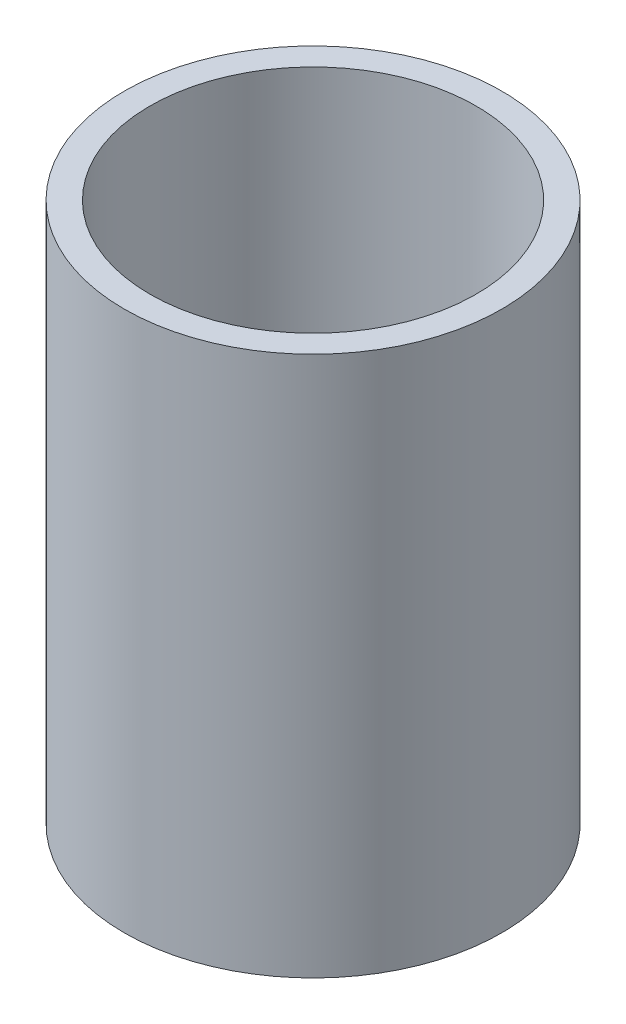
ISO-10303-21;
HEADER;
FILE_DESCRIPTION(('STEP AP214'),'2;1');
FILE_NAME('part.step','',(''),(''),'','','');
FILE_SCHEMA(('AUTOMOTIVE_DESIGN { 1 0 10303 214 1 1 1 1 }'));
ENDSEC;
DATA;
#1=APPLICATION_CONTEXT('core data for automotive mechanical design processes');
#2=APPLICATION_PROTOCOL_DEFINITION('international standard','automotive_design',2000,#1);
#3=PRODUCT_CONTEXT('',#1,'mechanical');
#4=PRODUCT('Part','Part','',(#3));
#5=PRODUCT_RELATED_PRODUCT_CATEGORY('part','',(#4));
#6=PRODUCT_DEFINITION_FORMATION('','',#4);
#7=PRODUCT_DEFINITION_CONTEXT('part definition',#1,'design');
#8=PRODUCT_DEFINITION('design','',#6,#7);
#9=PRODUCT_DEFINITION_SHAPE('','',#8);
#10=(LENGTH_UNIT() NAMED_UNIT(*) SI_UNIT(.MILLI.,.METRE.));
#11=(NAMED_UNIT(*) PLANE_ANGLE_UNIT() SI_UNIT($,.RADIAN.));
#12=(NAMED_UNIT(*) SI_UNIT($,.STERADIAN.) SOLID_ANGLE_UNIT());
#13=UNCERTAINTY_MEASURE_WITH_UNIT(LENGTH_MEASURE(1.E-05),#10,'distance_accuracy_value','');
#14=(GEOMETRIC_REPRESENTATION_CONTEXT(3) GLOBAL_UNCERTAINTY_ASSIGNED_CONTEXT((#13)) GLOBAL_UNIT_ASSIGNED_CONTEXT((#10,
#11,#12)) REPRESENTATION_CONTEXT('',''));
#15=CARTESIAN_POINT('',(0.,0.,0.));
#16=DIRECTION('',(0.,0.,1.));
#17=DIRECTION('',(1.,0.,0.));
#18=AXIS2_PLACEMENT_3D('',#15,#16,#17);
#19=CARTESIAN_POINT('',(0.,55.,0.));
#20=DIRECTION('',(0.,1.,0.));
#21=DIRECTION('',(0.,0.,1.));
#22=AXIS2_PLACEMENT_3D('',#19,#20,#21);
#23=CYLINDRICAL_SURFACE('',#22,46.609);
#24=CARTESIAN_POINT('',(0.,-87.732365567385,0.));
#25=DIRECTION('',(0.,1.,0.));
#26=DIRECTION('',(0.,0.,1.));
#27=AXIS2_PLACEMENT_3D('',#24,#25,#26);
#28=CIRCLE('',#27,46.609);
#29=CARTESIAN_POINT('',(0.,-87.732365567385,46.609));
#30=VERTEX_POINT('',#29);
#31=EDGE_CURVE('E12',#30,#30,#28,.T.);
#32=ORIENTED_EDGE('',*,*,#31,.T.);
#33=EDGE_LOOP('',(#32));
#34=FACE_BOUND('',#33,.T.);
#35=CARTESIAN_POINT('',(0.,45.6176344326149,0.));
#36=DIRECTION('',(0.,1.,0.));
#37=DIRECTION('',(0.,0.,1.));
#38=AXIS2_PLACEMENT_3D('',#35,#36,#37);
#39=CIRCLE('',#38,46.609);
#40=CARTESIAN_POINT('',(0.,45.6176344326149,46.609));
#41=VERTEX_POINT('',#40);
#42=EDGE_CURVE('E55',#41,#41,#39,.T.);
#43=ORIENTED_EDGE('',*,*,#42,.F.);
#44=EDGE_LOOP('',(#43));
#45=FACE_BOUND('',#44,.T.);
#46=ADVANCED_FACE('F41',(#34,#45),#23,.T.);
#47=CARTESIAN_POINT('',(-46.609,-87.7323655673851,0.));
#48=DIRECTION('',(0.,-1.,0.));
#49=DIRECTION('',(0.,0.,-1.));
#50=AXIS2_PLACEMENT_3D('',#47,#48,#49);
#51=PLANE('',#50);
#52=CARTESIAN_POINT('',(0.,-87.732365567385,0.));
#53=DIRECTION('',(0.,1.,0.));
#54=DIRECTION('',(0.,0.,1.));
#55=AXIS2_PLACEMENT_3D('',#52,#53,#54);
#56=CIRCLE('',#55,40.259);
#57=CARTESIAN_POINT('',(0.,-87.732365567385,40.259));
#58=VERTEX_POINT('',#57);
#59=EDGE_CURVE('E47',#58,#58,#56,.T.);
#60=ORIENTED_EDGE('',*,*,#59,.T.);
#61=EDGE_LOOP('',(#60));
#62=FACE_BOUND('',#61,.T.);
#63=ORIENTED_EDGE('',*,*,#31,.F.);
#64=EDGE_LOOP('',(#63));
#65=FACE_BOUND('',#64,.T.);
#66=ADVANCED_FACE('F65',(#62,#65),#51,.T.);
#67=CARTESIAN_POINT('',(0.,55.,0.));
#68=DIRECTION('',(0.,1.,0.));
#69=DIRECTION('',(0.,0.,1.));
#70=AXIS2_PLACEMENT_3D('',#67,#68,#69);
#71=CYLINDRICAL_SURFACE('',#70,40.259);
#72=CARTESIAN_POINT('',(0.,45.6176344326149,0.));
#73=DIRECTION('',(0.,1.,0.));
#74=DIRECTION('',(0.,0.,1.));
#75=AXIS2_PLACEMENT_3D('',#72,#73,#74);
#76=CIRCLE('',#75,40.259);
#77=CARTESIAN_POINT('',(0.,45.6176344326149,40.259));
#78=VERTEX_POINT('',#77);
#79=EDGE_CURVE('E51',#78,#78,#76,.T.);
#80=ORIENTED_EDGE('',*,*,#79,.T.);
#81=EDGE_LOOP('',(#80));
#82=FACE_BOUND('',#81,.T.);
#83=ORIENTED_EDGE('',*,*,#59,.F.);
#84=EDGE_LOOP('',(#83));
#85=FACE_BOUND('',#84,.T.);
#86=ADVANCED_FACE('F69',(#82,#85),#71,.F.);
#87=CARTESIAN_POINT('',(-46.609,45.6176344326149,0.));
#88=DIRECTION('',(0.,1.,0.));
#89=DIRECTION('',(0.,0.,1.));
#90=AXIS2_PLACEMENT_3D('',#87,#88,#89);
#91=PLANE('',#90);
#92=ORIENTED_EDGE('',*,*,#42,.T.);
#93=EDGE_LOOP('',(#92));
#94=FACE_BOUND('',#93,.T.);
#95=ORIENTED_EDGE('',*,*,#79,.F.);
#96=EDGE_LOOP('',(#95));
#97=FACE_BOUND('',#96,.T.);
#98=ADVANCED_FACE('F61',(#94,#97),#91,.T.);
#99=CLOSED_SHELL('',(#46,#66,#86,#98));
#100=MANIFOLD_SOLID_BREP('B2',#99);
#101=ADVANCED_BREP_SHAPE_REPRESENTATION('',(#18,#100),#14);
#102=SHAPE_DEFINITION_REPRESENTATION(#9,#101);
ENDSEC;
END-ISO-10303-21;
